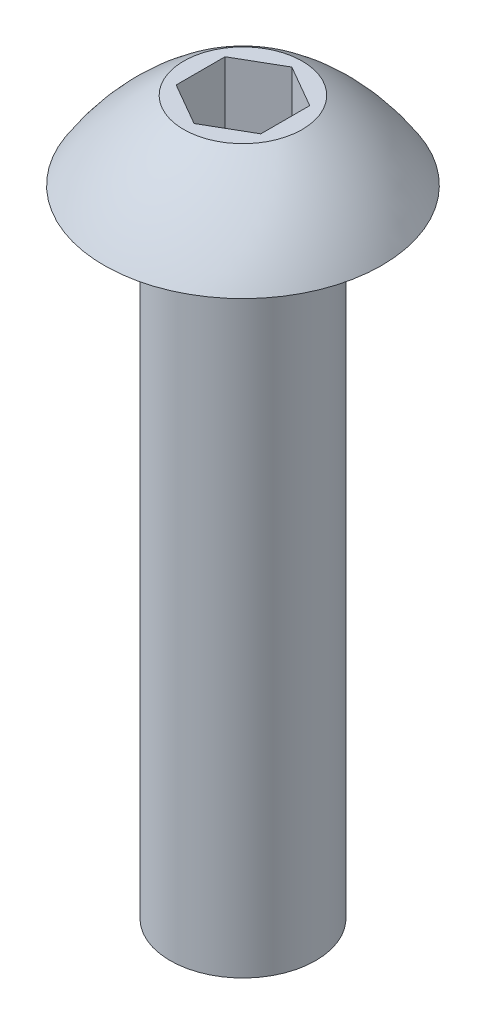
ISO-10303-21;
HEADER;
FILE_DESCRIPTION(('STEP AP214'),'2;1');
FILE_NAME('part.step','',(''),(''),'','','');
FILE_SCHEMA(('AUTOMOTIVE_DESIGN { 1 0 10303 214 1 1 1 1 }'));
ENDSEC;
DATA;
#1=APPLICATION_CONTEXT('core data for automotive mechanical design processes');
#2=APPLICATION_PROTOCOL_DEFINITION('international standard','automotive_design',2000,#1);
#3=PRODUCT_CONTEXT('',#1,'mechanical');
#4=PRODUCT('Part','Part','',(#3));
#5=PRODUCT_RELATED_PRODUCT_CATEGORY('part','',(#4));
#6=PRODUCT_DEFINITION_FORMATION('','',#4);
#7=PRODUCT_DEFINITION_CONTEXT('part definition',#1,'design');
#8=PRODUCT_DEFINITION('design','',#6,#7);
#9=PRODUCT_DEFINITION_SHAPE('','',#8);
#10=(LENGTH_UNIT() NAMED_UNIT(*) SI_UNIT(.MILLI.,.METRE.));
#11=(NAMED_UNIT(*) PLANE_ANGLE_UNIT() SI_UNIT($,.RADIAN.));
#12=(NAMED_UNIT(*) SI_UNIT($,.STERADIAN.) SOLID_ANGLE_UNIT());
#13=UNCERTAINTY_MEASURE_WITH_UNIT(LENGTH_MEASURE(1.E-05),#10,'distance_accuracy_value','');
#14=(GEOMETRIC_REPRESENTATION_CONTEXT(3) GLOBAL_UNCERTAINTY_ASSIGNED_CONTEXT((#13)) GLOBAL_UNIT_ASSIGNED_CONTEXT((#10,
#11,#12)) REPRESENTATION_CONTEXT('',''));
#15=CARTESIAN_POINT('',(0.,0.,0.));
#16=DIRECTION('',(0.,0.,1.));
#17=DIRECTION('',(1.,0.,0.));
#18=AXIS2_PLACEMENT_3D('',#15,#16,#17);
#19=CARTESIAN_POINT('',(0.,-9.525,0.));
#20=DIRECTION('',(0.,-1.,0.));
#21=DIRECTION('',(1.,0.,0.));
#22=AXIS2_PLACEMENT_3D('',#19,#20,#21);
#23=CYLINDRICAL_SURFACE('',#22,1.0922);
#24=CARTESIAN_POINT('',(0.,-9.525,0.));
#25=DIRECTION('',(0.,-1.,0.));
#26=DIRECTION('',(1.,0.,0.));
#27=AXIS2_PLACEMENT_3D('',#24,#25,#26);
#28=CIRCLE('',#27,1.0922);
#29=CARTESIAN_POINT('',(1.0922,-9.525,0.));
#30=VERTEX_POINT('',#29);
#31=EDGE_CURVE('E136',#30,#30,#28,.T.);
#32=ORIENTED_EDGE('',*,*,#31,.F.);
#33=EDGE_LOOP('',(#32));
#34=FACE_BOUND('',#33,.T.);
#35=CARTESIAN_POINT('',(0.,0.,0.));
#36=DIRECTION('',(0.,-1.,0.));
#37=DIRECTION('',(1.,0.,0.));
#38=AXIS2_PLACEMENT_3D('',#35,#36,#37);
#39=CIRCLE('',#38,1.0922);
#40=CARTESIAN_POINT('',(1.0922,0.,0.));
#41=VERTEX_POINT('',#40);
#42=EDGE_CURVE('E11',#41,#41,#39,.T.);
#43=ORIENTED_EDGE('',*,*,#42,.T.);
#44=EDGE_LOOP('',(#43));
#45=FACE_BOUND('',#44,.T.);
#46=ADVANCED_FACE('F35',(#34,#45),#23,.T.);
#47=CARTESIAN_POINT('',(-1.0922,0.,0.));
#48=DIRECTION('',(0.,1.,0.));
#49=DIRECTION('',(-1.,0.,0.));
#50=AXIS2_PLACEMENT_3D('',#47,#48,#49);
#51=PLANE('',#50);
#52=ORIENTED_EDGE('',*,*,#42,.F.);
#53=EDGE_LOOP('',(#52));
#54=FACE_BOUND('',#53,.T.);
#55=CARTESIAN_POINT('',(0.,0.,0.));
#56=DIRECTION('',(0.,-1.,0.));
#57=DIRECTION('',(1.,0.,0.));
#58=AXIS2_PLACEMENT_3D('',#55,#56,#57);
#59=CIRCLE('',#58,2.0828);
#60=CARTESIAN_POINT('',(2.0828,0.,0.));
#61=VERTEX_POINT('',#60);
#62=EDGE_CURVE('E42',#61,#61,#59,.T.);
#63=ORIENTED_EDGE('',*,*,#62,.T.);
#64=EDGE_LOOP('',(#63));
#65=FACE_BOUND('',#64,.T.);
#66=ADVANCED_FACE('F149',(#54,#65),#51,.F.);
#67=CARTESIAN_POINT('',(0.,-1.88994850901782,0.));
#68=DIRECTION('',(0.,-1.,0.));
#69=DIRECTION('',(1.,0.,0.));
#70=AXIS2_PLACEMENT_3D('',#67,#68,#69);
#71=DEGENERATE_TOROIDAL_SURFACE('',#70,0.935607051379142,3.5612759643917,.F.);
#72=ORIENTED_EDGE('',*,*,#62,.F.);
#73=EDGE_LOOP('',(#72));
#74=FACE_BOUND('',#73,.T.);
#75=CARTESIAN_POINT('',(0.,1.1684,0.));
#76=DIRECTION('',(0.,-1.,0.));
#77=DIRECTION('',(1.,0.,0.));
#78=AXIS2_PLACEMENT_3D('',#75,#76,#77);
#79=CIRCLE('',#78,0.889);
#80=CARTESIAN_POINT('',(0.889,1.1684,0.));
#81=VERTEX_POINT('',#80);
#82=EDGE_CURVE('E144',#81,#81,#79,.T.);
#83=ORIENTED_EDGE('',*,*,#82,.T.);
#84=EDGE_LOOP('',(#83));
#85=FACE_BOUND('',#84,.T.);
#86=ADVANCED_FACE('F151',(#74,#85),#71,.F.);
#87=CARTESIAN_POINT('',(0.,1.1684,0.));
#88=DIRECTION('',(0.,-1.,0.));
#89=DIRECTION('',(1.,0.,0.));
#90=AXIS2_PLACEMENT_3D('',#87,#88,#89);
#91=PLANE('',#90);
#92=DIRECTION('',(0.,0.,1.));
#93=VECTOR('',#92,1.);
#94=CARTESIAN_POINT('',(-0.635,1.1684,-0.366617420935412));
#95=LINE('',#94,#93);
#96=CARTESIAN_POINT('',(-0.635,1.1684,-0.366617420935412));
#97=VERTEX_POINT('',#96);
#98=CARTESIAN_POINT('',(-0.635,1.1684,0.366617420935412));
#99=VERTEX_POINT('',#98);
#100=EDGE_CURVE('E123',#97,#99,#95,.T.);
#101=ORIENTED_EDGE('',*,*,#100,.F.);
#102=DIRECTION('',(-0.866025403784438,0.,0.5));
#103=VECTOR('',#102,1.);
#104=CARTESIAN_POINT('',(0.,1.1684,-0.733234841870825));
#105=LINE('',#104,#103);
#106=CARTESIAN_POINT('',(0.,1.1684,-0.733234841870825));
#107=VERTEX_POINT('',#106);
#108=EDGE_CURVE('E49',#107,#97,#105,.T.);
#109=ORIENTED_EDGE('',*,*,#108,.F.);
#110=DIRECTION('',(-0.866025403784439,0.,-0.5));
#111=VECTOR('',#110,1.);
#112=CARTESIAN_POINT('',(0.635,1.1684,-0.366617420935413));
#113=LINE('',#112,#111);
#114=CARTESIAN_POINT('',(0.635,1.1684,-0.366617420935413));
#115=VERTEX_POINT('',#114);
#116=EDGE_CURVE('E132',#115,#107,#113,.T.);
#117=ORIENTED_EDGE('',*,*,#116,.F.);
#118=DIRECTION('',(0.,0.,-1.));
#119=VECTOR('',#118,1.);
#120=CARTESIAN_POINT('',(0.635,1.1684,0.366617420935412));
#121=LINE('',#120,#119);
#122=CARTESIAN_POINT('',(0.635,1.1684,0.366617420935412));
#123=VERTEX_POINT('',#122);
#124=EDGE_CURVE('E130',#123,#115,#121,.T.);
#125=ORIENTED_EDGE('',*,*,#124,.F.);
#126=DIRECTION('',(0.866025403784439,0.,-0.5));
#127=VECTOR('',#126,1.);
#128=CARTESIAN_POINT('',(0.,1.1684,0.733234841870825));
#129=LINE('',#128,#127);
#130=CARTESIAN_POINT('',(0.,1.1684,0.733234841870825));
#131=VERTEX_POINT('',#130);
#132=EDGE_CURVE('E97',#131,#123,#129,.T.);
#133=ORIENTED_EDGE('',*,*,#132,.F.);
#134=DIRECTION('',(0.866025403784439,0.,0.5));
#135=VECTOR('',#134,1.);
#136=CARTESIAN_POINT('',(-0.635,1.1684,0.366617420935412));
#137=LINE('',#136,#135);
#138=EDGE_CURVE('E126',#99,#131,#137,.T.);
#139=ORIENTED_EDGE('',*,*,#138,.F.);
#140=EDGE_LOOP('',(#101,#109,#117,#125,#133,#139));
#141=FACE_BOUND('',#140,.T.);
#142=ORIENTED_EDGE('',*,*,#82,.F.);
#143=EDGE_LOOP('',(#142));
#144=FACE_BOUND('',#143,.T.);
#145=ADVANCED_FACE('F154',(#141,#144),#91,.F.);
#146=CARTESIAN_POINT('',(-1.0922,-9.525,0.));
#147=DIRECTION('',(0.,1.,0.));
#148=DIRECTION('',(-1.,0.,0.));
#149=AXIS2_PLACEMENT_3D('',#146,#147,#148);
#150=PLANE('',#149);
#151=ORIENTED_EDGE('',*,*,#31,.T.);
#152=EDGE_LOOP('',(#151));
#153=FACE_BOUND('',#152,.T.);
#154=ADVANCED_FACE('F159',(#153),#150,.F.);
#155=CARTESIAN_POINT('',(0.,-0.1016,-0.733234841870825));
#156=DIRECTION('',(-0.5,0.,-0.866025403784439));
#157=DIRECTION('',(-0.866025403784439,0.,0.5));
#158=AXIS2_PLACEMENT_3D('',#155,#156,#157);
#159=PLANE('',#158);
#160=ORIENTED_EDGE('',*,*,#108,.T.);
#161=DIRECTION('',(0.,1.,0.));
#162=VECTOR('',#161,1.);
#163=CARTESIAN_POINT('',(-0.635,-0.1016,-0.366617420935412));
#164=LINE('',#163,#162);
#165=CARTESIAN_POINT('',(-0.635,-0.1016,-0.366617420935412));
#166=VERTEX_POINT('',#165);
#167=EDGE_CURVE('E79',#166,#97,#164,.T.);
#168=ORIENTED_EDGE('',*,*,#167,.F.);
#169=DIRECTION('',(-0.866025403784438,0.,0.5));
#170=VECTOR('',#169,1.);
#171=CARTESIAN_POINT('',(0.,-0.1016,-0.733234841870825));
#172=LINE('',#171,#170);
#173=CARTESIAN_POINT('',(0.,-0.1016,-0.733234841870825));
#174=VERTEX_POINT('',#173);
#175=EDGE_CURVE('E134',#174,#166,#172,.T.);
#176=ORIENTED_EDGE('',*,*,#175,.F.);
#177=DIRECTION('',(0.,1.,0.));
#178=VECTOR('',#177,1.);
#179=CARTESIAN_POINT('',(0.,-0.1016,-0.733234841870825));
#180=LINE('',#179,#178);
#181=EDGE_CURVE('E57',#174,#107,#180,.T.);
#182=ORIENTED_EDGE('',*,*,#181,.T.);
#183=EDGE_LOOP('',(#160,#168,#176,#182));
#184=FACE_BOUND('',#183,.T.);
#185=ADVANCED_FACE('F165',(#184),#159,.F.);
#186=CARTESIAN_POINT('',(0.635,-0.1016,-0.366617420935413));
#187=DIRECTION('',(0.5,0.,-0.866025403784439));
#188=DIRECTION('',(-0.866025403784439,0.,-0.5));
#189=AXIS2_PLACEMENT_3D('',#186,#187,#188);
#190=PLANE('',#189);
#191=ORIENTED_EDGE('',*,*,#116,.T.);
#192=ORIENTED_EDGE('',*,*,#181,.F.);
#193=DIRECTION('',(-0.866025403784439,0.,-0.5));
#194=VECTOR('',#193,1.);
#195=CARTESIAN_POINT('',(0.635,-0.1016,-0.366617420935413));
#196=LINE('',#195,#194);
#197=CARTESIAN_POINT('',(0.635,-0.1016,-0.366617420935413));
#198=VERTEX_POINT('',#197);
#199=EDGE_CURVE('E109',#198,#174,#196,.T.);
#200=ORIENTED_EDGE('',*,*,#199,.F.);
#201=DIRECTION('',(0.,1.,0.));
#202=VECTOR('',#201,1.);
#203=CARTESIAN_POINT('',(0.635,-0.1016,-0.366617420935413));
#204=LINE('',#203,#202);
#205=EDGE_CURVE('E101',#198,#115,#204,.T.);
#206=ORIENTED_EDGE('',*,*,#205,.T.);
#207=EDGE_LOOP('',(#191,#192,#200,#206));
#208=FACE_BOUND('',#207,.T.);
#209=ADVANCED_FACE('F203',(#208),#190,.F.);
#210=CARTESIAN_POINT('',(0.635,-0.1016,0.366617420935412));
#211=DIRECTION('',(1.,0.,0.));
#212=DIRECTION('',(0.,0.,-1.));
#213=AXIS2_PLACEMENT_3D('',#210,#211,#212);
#214=PLANE('',#213);
#215=ORIENTED_EDGE('',*,*,#124,.T.);
#216=ORIENTED_EDGE('',*,*,#205,.F.);
#217=DIRECTION('',(0.,0.,-1.));
#218=VECTOR('',#217,1.);
#219=CARTESIAN_POINT('',(0.635,-0.1016,0.366617420935412));
#220=LINE('',#219,#218);
#221=CARTESIAN_POINT('',(0.635,-0.1016,0.366617420935412));
#222=VERTEX_POINT('',#221);
#223=EDGE_CURVE('E105',#222,#198,#220,.T.);
#224=ORIENTED_EDGE('',*,*,#223,.F.);
#225=DIRECTION('',(0.,1.,0.));
#226=VECTOR('',#225,1.);
#227=CARTESIAN_POINT('',(0.635,-0.1016,0.366617420935412));
#228=LINE('',#227,#226);
#229=EDGE_CURVE('E90',#222,#123,#228,.T.);
#230=ORIENTED_EDGE('',*,*,#229,.T.);
#231=EDGE_LOOP('',(#215,#216,#224,#230));
#232=FACE_BOUND('',#231,.T.);
#233=ADVANCED_FACE('F106',(#232),#214,.F.);
#234=CARTESIAN_POINT('',(0.,-0.1016,0.733234841870825));
#235=DIRECTION('',(0.5,0.,0.866025403784438));
#236=DIRECTION('',(0.866025403784439,0.,-0.5));
#237=AXIS2_PLACEMENT_3D('',#234,#235,#236);
#238=PLANE('',#237);
#239=ORIENTED_EDGE('',*,*,#132,.T.);
#240=ORIENTED_EDGE('',*,*,#229,.F.);
#241=DIRECTION('',(0.866025403784439,0.,-0.5));
#242=VECTOR('',#241,1.);
#243=CARTESIAN_POINT('',(0.,-0.1016,0.733234841870825));
#244=LINE('',#243,#242);
#245=CARTESIAN_POINT('',(0.,-0.1016,0.733234841870825));
#246=VERTEX_POINT('',#245);
#247=EDGE_CURVE('E94',#246,#222,#244,.T.);
#248=ORIENTED_EDGE('',*,*,#247,.F.);
#249=DIRECTION('',(0.,1.,0.));
#250=VECTOR('',#249,1.);
#251=CARTESIAN_POINT('',(0.,-0.1016,0.733234841870825));
#252=LINE('',#251,#250);
#253=EDGE_CURVE('E102',#246,#131,#252,.T.);
#254=ORIENTED_EDGE('',*,*,#253,.T.);
#255=EDGE_LOOP('',(#239,#240,#248,#254));
#256=FACE_BOUND('',#255,.T.);
#257=ADVANCED_FACE('F92',(#256),#238,.F.);
#258=CARTESIAN_POINT('',(-0.635,-0.1016,0.366617420935412));
#259=DIRECTION('',(-0.5,0.,0.866025403784439));
#260=DIRECTION('',(0.866025403784439,0.,0.5));
#261=AXIS2_PLACEMENT_3D('',#258,#259,#260);
#262=PLANE('',#261);
#263=ORIENTED_EDGE('',*,*,#138,.T.);
#264=ORIENTED_EDGE('',*,*,#253,.F.);
#265=DIRECTION('',(0.866025403784439,0.,0.5));
#266=VECTOR('',#265,1.);
#267=CARTESIAN_POINT('',(-0.635,-0.1016,0.366617420935412));
#268=LINE('',#267,#266);
#269=CARTESIAN_POINT('',(-0.635,-0.1016,0.366617420935412));
#270=VERTEX_POINT('',#269);
#271=EDGE_CURVE('E115',#270,#246,#268,.T.);
#272=ORIENTED_EDGE('',*,*,#271,.F.);
#273=DIRECTION('',(0.,1.,0.));
#274=VECTOR('',#273,1.);
#275=CARTESIAN_POINT('',(-0.635,-0.1016,0.366617420935412));
#276=LINE('',#275,#274);
#277=EDGE_CURVE('E139',#270,#99,#276,.T.);
#278=ORIENTED_EDGE('',*,*,#277,.T.);
#279=EDGE_LOOP('',(#263,#264,#272,#278));
#280=FACE_BOUND('',#279,.T.);
#281=ADVANCED_FACE('F228',(#280),#262,.F.);
#282=CARTESIAN_POINT('',(-0.635,-0.1016,-0.366617420935412));
#283=DIRECTION('',(-1.,0.,0.));
#284=DIRECTION('',(0.,0.,1.));
#285=AXIS2_PLACEMENT_3D('',#282,#283,#284);
#286=PLANE('',#285);
#287=ORIENTED_EDGE('',*,*,#100,.T.);
#288=ORIENTED_EDGE('',*,*,#277,.F.);
#289=DIRECTION('',(0.,0.,1.));
#290=VECTOR('',#289,1.);
#291=CARTESIAN_POINT('',(-0.635,-0.1016,-0.366617420935412));
#292=LINE('',#291,#290);
#293=EDGE_CURVE('E117',#166,#270,#292,.T.);
#294=ORIENTED_EDGE('',*,*,#293,.F.);
#295=ORIENTED_EDGE('',*,*,#167,.T.);
#296=EDGE_LOOP('',(#287,#288,#294,#295));
#297=FACE_BOUND('',#296,.T.);
#298=ADVANCED_FACE('F237',(#297),#286,.F.);
#299=CARTESIAN_POINT('',(0.,-0.1016,0.));
#300=DIRECTION('',(0.,1.,0.));
#301=DIRECTION('',(0.,0.,1.));
#302=AXIS2_PLACEMENT_3D('',#299,#300,#301);
#303=PLANE('',#302);
#304=ORIENTED_EDGE('',*,*,#175,.T.);
#305=ORIENTED_EDGE('',*,*,#293,.T.);
#306=ORIENTED_EDGE('',*,*,#271,.T.);
#307=ORIENTED_EDGE('',*,*,#247,.T.);
#308=ORIENTED_EDGE('',*,*,#223,.T.);
#309=ORIENTED_EDGE('',*,*,#199,.T.);
#310=EDGE_LOOP('',(#304,#305,#306,#307,#308,#309));
#311=FACE_BOUND('',#310,.T.);
#312=ADVANCED_FACE('F112',(#311),#303,.T.);
#313=CLOSED_SHELL('',(#46,#66,#86,#145,#154,#185,#209,#233,#257,#281,#298,#312));
#314=MANIFOLD_SOLID_BREP('B2',#313);
#315=ADVANCED_BREP_SHAPE_REPRESENTATION('',(#18,#314),#14);
#316=SHAPE_DEFINITION_REPRESENTATION(#9,#315);
ENDSEC;
END-ISO-10303-21;
